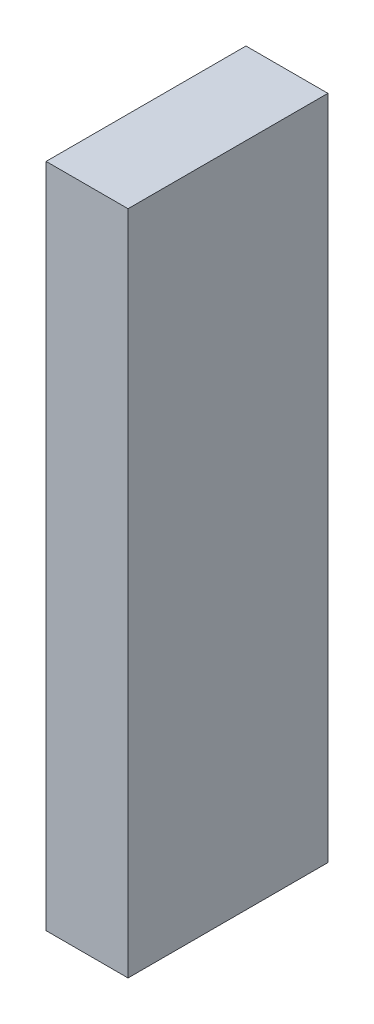
ISO-10303-21;
HEADER;
FILE_DESCRIPTION(('STEP AP214'),'2;1');
FILE_NAME('part.step','',(''),(''),'','','');
FILE_SCHEMA(('AUTOMOTIVE_DESIGN { 1 0 10303 214 1 1 1 1 }'));
ENDSEC;
DATA;
#1=APPLICATION_CONTEXT('core data for automotive mechanical design processes');
#2=APPLICATION_PROTOCOL_DEFINITION('international standard','automotive_design',2000,#1);
#3=PRODUCT_CONTEXT('',#1,'mechanical');
#4=PRODUCT('Part','Part','',(#3));
#5=PRODUCT_RELATED_PRODUCT_CATEGORY('part','',(#4));
#6=PRODUCT_DEFINITION_FORMATION('','',#4);
#7=PRODUCT_DEFINITION_CONTEXT('part definition',#1,'design');
#8=PRODUCT_DEFINITION('design','',#6,#7);
#9=PRODUCT_DEFINITION_SHAPE('','',#8);
#10=(LENGTH_UNIT() NAMED_UNIT(*) SI_UNIT(.MILLI.,.METRE.));
#11=(NAMED_UNIT(*) PLANE_ANGLE_UNIT() SI_UNIT($,.RADIAN.));
#12=(NAMED_UNIT(*) SI_UNIT($,.STERADIAN.) SOLID_ANGLE_UNIT());
#13=UNCERTAINTY_MEASURE_WITH_UNIT(LENGTH_MEASURE(1.E-05),#10,'distance_accuracy_value','');
#14=(GEOMETRIC_REPRESENTATION_CONTEXT(3) GLOBAL_UNCERTAINTY_ASSIGNED_CONTEXT((#13)) GLOBAL_UNIT_ASSIGNED_CONTEXT((#10,
#11,#12)) REPRESENTATION_CONTEXT('',''));
#15=CARTESIAN_POINT('',(0.,0.,0.));
#16=DIRECTION('',(0.,0.,1.));
#17=DIRECTION('',(1.,0.,0.));
#18=AXIS2_PLACEMENT_3D('',#15,#16,#17);
#19=CARTESIAN_POINT('',(6.23,0.,1.5));
#20=DIRECTION('',(0.,-1.,0.));
#21=DIRECTION('',(1.,0.,0.));
#22=AXIS2_PLACEMENT_3D('',#19,#20,#21);
#23=PLANE('',#22);
#24=DIRECTION('',(0.,0.,1.));
#25=VECTOR('',#24,1.);
#26=CARTESIAN_POINT('',(5.,0.,1.5));
#27=LINE('',#26,#25);
#28=CARTESIAN_POINT('',(5.,0.,-1.5));
#29=VERTEX_POINT('',#28);
#30=CARTESIAN_POINT('',(5.,0.,1.5));
#31=VERTEX_POINT('',#30);
#32=EDGE_CURVE('E11',#29,#31,#27,.T.);
#33=ORIENTED_EDGE('',*,*,#32,.T.);
#34=DIRECTION('',(-1.,0.,0.));
#35=VECTOR('',#34,1.);
#36=CARTESIAN_POINT('',(6.23,0.,1.5));
#37=LINE('',#36,#35);
#38=CARTESIAN_POINT('',(6.23,0.,1.5));
#39=VERTEX_POINT('',#38);
#40=EDGE_CURVE('E25',#39,#31,#37,.T.);
#41=ORIENTED_EDGE('',*,*,#40,.F.);
#42=DIRECTION('',(0.,0.,1.));
#43=VECTOR('',#42,1.);
#44=CARTESIAN_POINT('',(6.23,0.,1.5));
#45=LINE('',#44,#43);
#46=CARTESIAN_POINT('',(6.23,0.,-1.5));
#47=VERTEX_POINT('',#46);
#48=EDGE_CURVE('E109',#47,#39,#45,.T.);
#49=ORIENTED_EDGE('',*,*,#48,.F.);
#50=DIRECTION('',(-1.,0.,0.));
#51=VECTOR('',#50,1.);
#52=CARTESIAN_POINT('',(6.23,0.,-1.5));
#53=LINE('',#52,#51);
#54=EDGE_CURVE('E83',#47,#29,#53,.T.);
#55=ORIENTED_EDGE('',*,*,#54,.T.);
#56=EDGE_LOOP('',(#33,#41,#49,#55));
#57=FACE_BOUND('',#56,.T.);
#58=ADVANCED_FACE('F17',(#57),#23,.F.);
#59=CARTESIAN_POINT('',(6.23,0.,1.5));
#60=DIRECTION('',(0.,0.,-1.));
#61=DIRECTION('',(0.,1.,0.));
#62=AXIS2_PLACEMENT_3D('',#59,#60,#61);
#63=PLANE('',#62);
#64=DIRECTION('',(0.,-1.,0.));
#65=VECTOR('',#64,1.);
#66=CARTESIAN_POINT('',(5.,0.,1.5));
#67=LINE('',#66,#65);
#68=CARTESIAN_POINT('',(5.,-10.,1.5));
#69=VERTEX_POINT('',#68);
#70=EDGE_CURVE('E104',#31,#69,#67,.T.);
#71=ORIENTED_EDGE('',*,*,#70,.T.);
#72=DIRECTION('',(-1.,0.,0.));
#73=VECTOR('',#72,1.);
#74=CARTESIAN_POINT('',(6.23,-10.,1.5));
#75=LINE('',#74,#73);
#76=CARTESIAN_POINT('',(6.23,-10.,1.5));
#77=VERTEX_POINT('',#76);
#78=EDGE_CURVE('E101',#77,#69,#75,.T.);
#79=ORIENTED_EDGE('',*,*,#78,.F.);
#80=DIRECTION('',(0.,-1.,0.));
#81=VECTOR('',#80,1.);
#82=CARTESIAN_POINT('',(6.23,0.,1.5));
#83=LINE('',#82,#81);
#84=EDGE_CURVE('E90',#39,#77,#83,.T.);
#85=ORIENTED_EDGE('',*,*,#84,.F.);
#86=ORIENTED_EDGE('',*,*,#40,.T.);
#87=EDGE_LOOP('',(#71,#79,#85,#86));
#88=FACE_BOUND('',#87,.T.);
#89=ADVANCED_FACE('F115',(#88),#63,.F.);
#90=CARTESIAN_POINT('',(6.23,-10.,1.5));
#91=DIRECTION('',(0.,1.,0.));
#92=DIRECTION('',(-1.,0.,0.));
#93=AXIS2_PLACEMENT_3D('',#90,#91,#92);
#94=PLANE('',#93);
#95=DIRECTION('',(0.,0.,-1.));
#96=VECTOR('',#95,1.);
#97=CARTESIAN_POINT('',(5.,-10.,1.5));
#98=LINE('',#97,#96);
#99=CARTESIAN_POINT('',(5.,-10.,-1.5));
#100=VERTEX_POINT('',#99);
#101=EDGE_CURVE('E73',#69,#100,#98,.T.);
#102=ORIENTED_EDGE('',*,*,#101,.T.);
#103=DIRECTION('',(-1.,0.,0.));
#104=VECTOR('',#103,1.);
#105=CARTESIAN_POINT('',(6.23,-10.,-1.5));
#106=LINE('',#105,#104);
#107=CARTESIAN_POINT('',(6.23,-10.,-1.5));
#108=VERTEX_POINT('',#107);
#109=EDGE_CURVE('E65',#108,#100,#106,.T.);
#110=ORIENTED_EDGE('',*,*,#109,.F.);
#111=DIRECTION('',(0.,0.,-1.));
#112=VECTOR('',#111,1.);
#113=CARTESIAN_POINT('',(6.23,-10.,1.5));
#114=LINE('',#113,#112);
#115=EDGE_CURVE('E70',#77,#108,#114,.T.);
#116=ORIENTED_EDGE('',*,*,#115,.F.);
#117=ORIENTED_EDGE('',*,*,#78,.T.);
#118=EDGE_LOOP('',(#102,#110,#116,#117));
#119=FACE_BOUND('',#118,.T.);
#120=ADVANCED_FACE('F67',(#119),#94,.F.);
#121=CARTESIAN_POINT('',(6.23,0.,-1.5));
#122=DIRECTION('',(0.,0.,1.));
#123=DIRECTION('',(0.,-1.,0.));
#124=AXIS2_PLACEMENT_3D('',#121,#122,#123);
#125=PLANE('',#124);
#126=DIRECTION('',(0.,1.,0.));
#127=VECTOR('',#126,1.);
#128=CARTESIAN_POINT('',(5.,0.,-1.5));
#129=LINE('',#128,#127);
#130=EDGE_CURVE('E87',#100,#29,#129,.T.);
#131=ORIENTED_EDGE('',*,*,#130,.T.);
#132=ORIENTED_EDGE('',*,*,#54,.F.);
#133=DIRECTION('',(0.,1.,0.));
#134=VECTOR('',#133,1.);
#135=CARTESIAN_POINT('',(6.23,0.,-1.5));
#136=LINE('',#135,#134);
#137=EDGE_CURVE('E81',#108,#47,#136,.T.);
#138=ORIENTED_EDGE('',*,*,#137,.F.);
#139=ORIENTED_EDGE('',*,*,#109,.T.);
#140=EDGE_LOOP('',(#131,#132,#138,#139));
#141=FACE_BOUND('',#140,.T.);
#142=ADVANCED_FACE('F82',(#141),#125,.F.);
#143=CARTESIAN_POINT('',(6.23,0.,0.));
#144=DIRECTION('',(-1.,0.,0.));
#145=DIRECTION('',(0.,-1.,0.));
#146=AXIS2_PLACEMENT_3D('',#143,#144,#145);
#147=PLANE('',#146);
#148=ORIENTED_EDGE('',*,*,#48,.T.);
#149=ORIENTED_EDGE('',*,*,#84,.T.);
#150=ORIENTED_EDGE('',*,*,#115,.T.);
#151=ORIENTED_EDGE('',*,*,#137,.T.);
#152=EDGE_LOOP('',(#148,#149,#150,#151));
#153=FACE_BOUND('',#152,.T.);
#154=ADVANCED_FACE('F89',(#153),#147,.F.);
#155=CARTESIAN_POINT('',(5.,0.,0.));
#156=DIRECTION('',(-1.,0.,0.));
#157=DIRECTION('',(0.,-1.,0.));
#158=AXIS2_PLACEMENT_3D('',#155,#156,#157);
#159=PLANE('',#158);
#160=ORIENTED_EDGE('',*,*,#32,.F.);
#161=ORIENTED_EDGE('',*,*,#130,.F.);
#162=ORIENTED_EDGE('',*,*,#101,.F.);
#163=ORIENTED_EDGE('',*,*,#70,.F.);
#164=EDGE_LOOP('',(#160,#161,#162,#163));
#165=FACE_BOUND('',#164,.T.);
#166=ADVANCED_FACE('F117',(#165),#159,.T.);
#167=CLOSED_SHELL('',(#58,#89,#120,#142,#154,#166));
#168=MANIFOLD_SOLID_BREP('B1',#167);
#169=ADVANCED_BREP_SHAPE_REPRESENTATION('',(#18,#168),#14);
#170=SHAPE_DEFINITION_REPRESENTATION(#9,#169);
ENDSEC;
END-ISO-10303-21;
